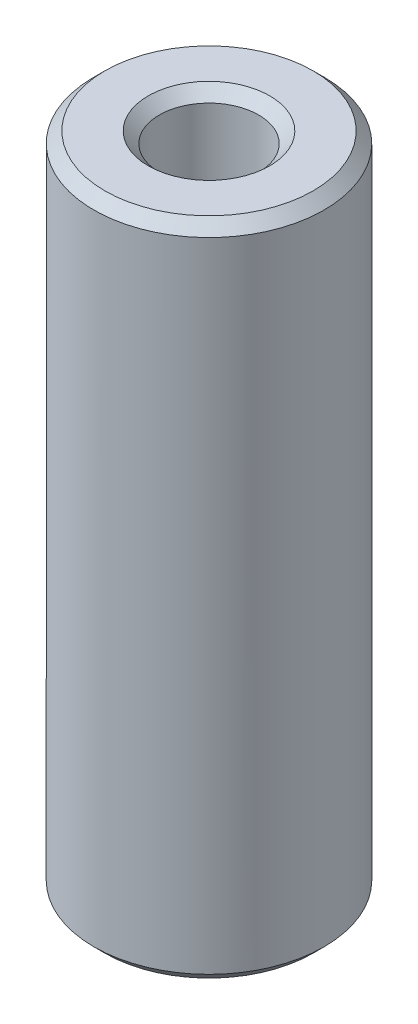
ISO-10303-21;
HEADER;
FILE_DESCRIPTION(('STEP AP214'),'2;1');
FILE_NAME('part.step','',(''),(''),'','','');
FILE_SCHEMA(('AUTOMOTIVE_DESIGN { 1 0 10303 214 1 1 1 1 }'));
ENDSEC;
DATA;
#1=APPLICATION_CONTEXT('core data for automotive mechanical design processes');
#2=APPLICATION_PROTOCOL_DEFINITION('international standard','automotive_design',2000,#1);
#3=PRODUCT_CONTEXT('',#1,'mechanical');
#4=PRODUCT('Part','Part','',(#3));
#5=PRODUCT_RELATED_PRODUCT_CATEGORY('part','',(#4));
#6=PRODUCT_DEFINITION_FORMATION('','',#4);
#7=PRODUCT_DEFINITION_CONTEXT('part definition',#1,'design');
#8=PRODUCT_DEFINITION('design','',#6,#7);
#9=PRODUCT_DEFINITION_SHAPE('','',#8);
#10=(LENGTH_UNIT() NAMED_UNIT(*) SI_UNIT(.MILLI.,.METRE.));
#11=(NAMED_UNIT(*) PLANE_ANGLE_UNIT() SI_UNIT($,.RADIAN.));
#12=(NAMED_UNIT(*) SI_UNIT($,.STERADIAN.) SOLID_ANGLE_UNIT());
#13=UNCERTAINTY_MEASURE_WITH_UNIT(LENGTH_MEASURE(1.E-05),#10,'distance_accuracy_value','');
#14=(GEOMETRIC_REPRESENTATION_CONTEXT(3) GLOBAL_UNCERTAINTY_ASSIGNED_CONTEXT((#13)) GLOBAL_UNIT_ASSIGNED_CONTEXT((#10,
#11,#12)) REPRESENTATION_CONTEXT('',''));
#15=CARTESIAN_POINT('',(0.,0.,0.));
#16=DIRECTION('',(0.,0.,1.));
#17=DIRECTION('',(1.,0.,0.));
#18=AXIS2_PLACEMENT_3D('',#15,#16,#17);
#19=CARTESIAN_POINT('',(0.,57.3546834768613,0.));
#20=DIRECTION('',(0.,-1.,0.));
#21=DIRECTION('',(0.,0.,-1.));
#22=AXIS2_PLACEMENT_3D('',#19,#20,#21);
#23=CYLINDRICAL_SURFACE('',#22,10.);
#24=CARTESIAN_POINT('',(0.,0.959451549505989,0.));
#25=DIRECTION('',(0.,1.,0.));
#26=DIRECTION('',(0.,0.,1.));
#27=AXIS2_PLACEMENT_3D('',#24,#25,#26);
#28=CIRCLE('',#27,10.);
#29=CARTESIAN_POINT('',(0.,0.959451549505989,-10.));
#30=VERTEX_POINT('',#29);
#31=EDGE_CURVE('E10',#30,#30,#28,.T.);
#32=CARTESIAN_POINT('',(0.,56.3952319273553,0.));
#33=DIRECTION('',(0.,1.,0.));
#34=DIRECTION('',(0.,0.,1.));
#35=AXIS2_PLACEMENT_3D('',#32,#33,#34);
#36=CIRCLE('',#35,10.);
#37=CARTESIAN_POINT('',(0.,56.3952319273553,-10.));
#38=VERTEX_POINT('',#37);
#39=EDGE_CURVE('E50',#38,#38,#36,.F.);
#40=CARTESIAN_POINT('',(0.,0.959451549505989,-10.));
#41=CARTESIAN_POINT('',(0.,1.53690759510859,-10.));
#42=CARTESIAN_POINT('',(0.,2.11436364071118,-10.));
#43=CARTESIAN_POINT('',(0.,3.26927573191638,-10.));
#44=CARTESIAN_POINT('',(0.,3.84673177751897,-10.));
#45=CARTESIAN_POINT('',(0.,5.00164386872416,-10.));
#46=CARTESIAN_POINT('',(0.,5.57909991432676,-10.));
#47=CARTESIAN_POINT('',(0.,6.73401200553195,-10.));
#48=CARTESIAN_POINT('',(0.,7.31146805113455,-10.));
#49=CARTESIAN_POINT('',(0.,8.46638014233974,-10.));
#50=CARTESIAN_POINT('',(0.,9.04383618794234,-10.));
#51=CARTESIAN_POINT('',(0.,10.1987482791475,-10.));
#52=CARTESIAN_POINT('',(0.,10.7762043247501,-10.));
#53=CARTESIAN_POINT('',(0.,11.9311164159553,-10.));
#54=CARTESIAN_POINT('',(0.,12.5085724615579,-10.));
#55=CARTESIAN_POINT('',(0.,13.6634845527631,-10.));
#56=CARTESIAN_POINT('',(0.,14.2409405983657,-10.));
#57=CARTESIAN_POINT('',(0.,15.3958526895709,-10.));
#58=CARTESIAN_POINT('',(0.,15.9733087351735,-10.));
#59=CARTESIAN_POINT('',(0.,17.1282208263787,-10.));
#60=CARTESIAN_POINT('',(0.,17.7056768719813,-10.));
#61=CARTESIAN_POINT('',(0.,18.8605889631865,-10.));
#62=CARTESIAN_POINT('',(0.,19.4380450087891,-10.));
#63=CARTESIAN_POINT('',(0.,20.5929570999943,-10.));
#64=CARTESIAN_POINT('',(0.,21.1704131455969,-10.));
#65=CARTESIAN_POINT('',(0.,22.3253252368021,-10.));
#66=CARTESIAN_POINT('',(0.,22.9027812824047,-10.));
#67=CARTESIAN_POINT('',(0.,24.0576933736099,-10.));
#68=CARTESIAN_POINT('',(0.,24.6351494192124,-10.));
#69=CARTESIAN_POINT('',(0.,25.7900615104176,-10.));
#70=CARTESIAN_POINT('',(0.,26.3675175560202,-10.));
#71=CARTESIAN_POINT('',(0.,27.5224296472254,-10.));
#72=CARTESIAN_POINT('',(0.,28.099885692828,-10.));
#73=CARTESIAN_POINT('',(0.,29.2547977840332,-10.));
#74=CARTESIAN_POINT('',(0.,29.8322538296358,-10.));
#75=CARTESIAN_POINT('',(0.,30.987165920841,-10.));
#76=CARTESIAN_POINT('',(0.,31.5646219664436,-10.));
#77=CARTESIAN_POINT('',(0.,32.7195340576488,-10.));
#78=CARTESIAN_POINT('',(0.,33.2969901032514,-10.));
#79=CARTESIAN_POINT('',(0.,34.4519021944566,-10.));
#80=CARTESIAN_POINT('',(0.,35.0293582400592,-10.));
#81=CARTESIAN_POINT('',(0.,36.1842703312644,-10.));
#82=CARTESIAN_POINT('',(0.,36.761726376867,-10.));
#83=CARTESIAN_POINT('',(0.,37.9166384680722,-10.));
#84=CARTESIAN_POINT('',(0.,38.4940945136748,-10.));
#85=CARTESIAN_POINT('',(0.,39.64900660488,-10.));
#86=CARTESIAN_POINT('',(0.,40.2264626504826,-10.));
#87=CARTESIAN_POINT('',(0.,41.3813747416877,-10.));
#88=CARTESIAN_POINT('',(0.,41.9588307872903,-10.));
#89=CARTESIAN_POINT('',(0.,43.1137428784955,-10.));
#90=CARTESIAN_POINT('',(0.,43.6911989240981,-10.));
#91=CARTESIAN_POINT('',(0.,44.8461110153033,-10.));
#92=CARTESIAN_POINT('',(0.,45.4235670609059,-10.));
#93=CARTESIAN_POINT('',(0.,46.5784791521111,-10.));
#94=CARTESIAN_POINT('',(0.,47.1559351977137,-10.));
#95=CARTESIAN_POINT('',(0.,48.3108472889189,-10.));
#96=CARTESIAN_POINT('',(0.,48.8883033345215,-10.));
#97=CARTESIAN_POINT('',(0.,50.0432154257267,-10.));
#98=CARTESIAN_POINT('',(0.,50.6206714713293,-10.));
#99=CARTESIAN_POINT('',(0.,51.7755835625345,-10.));
#100=CARTESIAN_POINT('',(0.,52.3530396081371,-10.));
#101=CARTESIAN_POINT('',(0.,53.5079516993423,-10.));
#102=CARTESIAN_POINT('',(0.,54.0854077449449,-10.));
#103=CARTESIAN_POINT('',(0.,55.2403198361501,-10.));
#104=CARTESIAN_POINT('',(0.,55.8177758817527,-10.));
#105=CARTESIAN_POINT('',(0.,56.3952319273553,-10.));
#106=B_SPLINE_CURVE_WITH_KNOTS('',3,(#40,#41,#42,#43,#44,#45,#46,#47,#48,#49,#50,#51,#52,#53,
#54,#55,#56,#57,#58,#59,#60,#61,#62,#63,#64,#65,#66,#67,#68,#69,#70,#71,#72,#73,#74,#75,#76,#77,
#78,#79,#80,#81,#82,#83,#84,#85,#86,#87,#88,#89,#90,#91,#92,#93,#94,#95,#96,#97,#98,#99,#100,
#101,#102,#103,#104,#105),.UNSPECIFIED.,.F.,.F.,(4,2,2,2,2,2,2,2,2,2,2,2,2,2,2,2,2,2,2,2,2,2,2,
2,2,2,2,2,2,2,2,2,4),(0.,1.73236813680779,3.46473627361558,5.19710441042337,6.92947254723116,
8.66184068403895,10.3942088208467,12.1265769576545,13.8589450944623,15.5913132312701,
17.3236813680779,19.0560495048857,20.7884176416935,22.5207857785013,24.2531539153091,
25.9855220521168,27.7178901889246,29.4502583257324,31.1826264625402,32.914994599348,
34.6473627361558,36.3797308729636,38.1120990097714,39.8444671465792,41.576835283387,
43.3092034201947,45.0415715570025,46.7739396938103,48.5063078306181,50.2386759674259,
51.9710441042337,53.7034122410415,55.4357803778493),.UNSPECIFIED.);
#107=EDGE_CURVE('BSEAM39',#30,#38,#106,.T.);
#108=ORIENTED_EDGE('',*,*,#31,.T.);
#109=ORIENTED_EDGE('',*,*,#39,.T.);
#110=ORIENTED_EDGE('',*,*,#107,.T.);
#111=ORIENTED_EDGE('',*,*,#107,.F.);
#112=EDGE_LOOP('',(#108,#110,#109,#111));
#113=FACE_BOUND('',#112,.T.);
#114=ADVANCED_FACE('F39',(#113),#23,.T.);
#115=CARTESIAN_POINT('',(0.,57.3546834768613,0.));
#116=DIRECTION('',(0.,1.,0.));
#117=DIRECTION('',(0.,0.,1.));
#118=AXIS2_PLACEMENT_3D('',#115,#116,#117);
#119=PLANE('',#118);
#120=CARTESIAN_POINT('',(0.,57.3546834768613,0.));
#121=DIRECTION('',(0.,1.,0.));
#122=DIRECTION('',(0.,0.,1.));
#123=AXIS2_PLACEMENT_3D('',#120,#121,#122);
#124=CIRCLE('',#123,5.27456071594514);
#125=CARTESIAN_POINT('',(0.,57.3546834768613,5.27456071594514));
#126=VERTEX_POINT('',#125);
#127=EDGE_CURVE('E58',#126,#126,#124,.F.);
#128=ORIENTED_EDGE('',*,*,#127,.T.);
#129=EDGE_LOOP('',(#128));
#130=FACE_BOUND('',#129,.T.);
#131=CARTESIAN_POINT('',(0.,57.3546834768613,0.));
#132=DIRECTION('',(0.,1.,0.));
#133=DIRECTION('',(0.,0.,1.));
#134=AXIS2_PLACEMENT_3D('',#131,#132,#133);
#135=CIRCLE('',#134,9.04054845049403);
#136=CARTESIAN_POINT('',(0.,57.3546834768613,-9.04054845049403));
#137=VERTEX_POINT('',#136);
#138=EDGE_CURVE('E61',#137,#137,#135,.T.);
#139=ORIENTED_EDGE('',*,*,#138,.T.);
#140=EDGE_LOOP('',(#139));
#141=FACE_BOUND('',#140,.T.);
#142=ADVANCED_FACE('F88',(#130,#141),#119,.T.);
#143=CARTESIAN_POINT('',(0.,0.,0.));
#144=DIRECTION('',(0.,1.,0.));
#145=DIRECTION('',(0.,0.,1.));
#146=AXIS2_PLACEMENT_3D('',#143,#144,#145);
#147=PLANE('',#146);
#148=CARTESIAN_POINT('',(0.,0.,0.));
#149=DIRECTION('',(0.,1.,0.));
#150=DIRECTION('',(0.,0.,1.));
#151=AXIS2_PLACEMENT_3D('',#148,#149,#150);
#152=CIRCLE('',#151,5.27456071594514);
#153=CARTESIAN_POINT('',(0.,0.,5.27456071594514));
#154=VERTEX_POINT('',#153);
#155=EDGE_CURVE('E51',#154,#154,#152,.T.);
#156=ORIENTED_EDGE('',*,*,#155,.T.);
#157=EDGE_LOOP('',(#156));
#158=FACE_BOUND('',#157,.T.);
#159=CARTESIAN_POINT('',(0.,0.,0.));
#160=DIRECTION('',(0.,1.,0.));
#161=DIRECTION('',(0.,0.,1.));
#162=AXIS2_PLACEMENT_3D('',#159,#160,#161);
#163=CIRCLE('',#162,9.04054845049401);
#164=CARTESIAN_POINT('',(0.,0.,9.04054845049401));
#165=VERTEX_POINT('',#164);
#166=EDGE_CURVE('E54',#165,#165,#163,.F.);
#167=ORIENTED_EDGE('',*,*,#166,.T.);
#168=EDGE_LOOP('',(#167));
#169=FACE_BOUND('',#168,.T.);
#170=ADVANCED_FACE('F83',(#158,#169),#147,.F.);
#171=CARTESIAN_POINT('',(0.,57.3546834768613,0.));
#172=DIRECTION('',(0.,-1.,0.));
#173=DIRECTION('',(0.,0.,-1.));
#174=AXIS2_PLACEMENT_3D('',#171,#172,#173);
#175=CYLINDRICAL_SURFACE('',#174,4.31510916643915);
#176=CARTESIAN_POINT('',(0.,56.3952319273553,0.));
#177=DIRECTION('',(0.,1.,0.));
#178=DIRECTION('',(0.,0.,1.));
#179=AXIS2_PLACEMENT_3D('',#176,#177,#178);
#180=CIRCLE('',#179,4.31510916643915);
#181=CARTESIAN_POINT('',(0.,56.3952319273553,4.31510916643915));
#182=VERTEX_POINT('',#181);
#183=EDGE_CURVE('E67',#182,#182,#180,.T.);
#184=ORIENTED_EDGE('',*,*,#183,.T.);
#185=EDGE_LOOP('',(#184));
#186=FACE_BOUND('',#185,.T.);
#187=CARTESIAN_POINT('',(0.,0.959451549505996,0.));
#188=DIRECTION('',(0.,1.,0.));
#189=DIRECTION('',(0.,0.,1.));
#190=AXIS2_PLACEMENT_3D('',#187,#188,#189);
#191=CIRCLE('',#190,4.31510916643915);
#192=CARTESIAN_POINT('',(0.,0.959451549505996,4.31510916643915));
#193=VERTEX_POINT('',#192);
#194=EDGE_CURVE('E69',#193,#193,#191,.F.);
#195=ORIENTED_EDGE('',*,*,#194,.T.);
#196=EDGE_LOOP('',(#195));
#197=FACE_BOUND('',#196,.T.);
#198=ADVANCED_FACE('F71',(#186,#197),#175,.F.);
#199=CARTESIAN_POINT('',(0.,56.3952319273553,0.));
#200=DIRECTION('',(0.,1.,0.));
#201=DIRECTION('',(0.,0.,1.));
#202=AXIS2_PLACEMENT_3D('',#199,#200,#201);
#203=CONICAL_SURFACE('',#202,4.31510916643915,0.785398163397447);
#204=CARTESIAN_POINT('',(0.,57.3546834768613,5.27456071594514));
#205=CARTESIAN_POINT('',(0.,57.3446891898872,5.26456642897112));
#206=CARTESIAN_POINT('',(0.,57.3346949029132,5.2545721419971));
#207=CARTESIAN_POINT('',(0.,57.3147063289652,5.23458356804906));
#208=CARTESIAN_POINT('',(0.,57.3047120419911,5.22458928107504));
#209=CARTESIAN_POINT('',(0.,57.2847234680431,5.20460070712699));
#210=CARTESIAN_POINT('',(0.,57.2747291810691,5.19460642015297));
#211=CARTESIAN_POINT('',(0.,57.254740607121,5.17461784620493));
#212=CARTESIAN_POINT('',(0.,57.244746320147,5.16462355923091));
#213=CARTESIAN_POINT('',(0.,57.224757746199,5.14463498528287));
#214=CARTESIAN_POINT('',(0.,57.214763459225,5.13464069830885));
#215=CARTESIAN_POINT('',(0.,57.1947748852769,5.11465212436081));
#216=CARTESIAN_POINT('',(0.,57.1847805983029,5.10465783738679));
#217=CARTESIAN_POINT('',(0.,57.1647920243549,5.08466926343874));
#218=CARTESIAN_POINT('',(0.,57.1547977373808,5.07467497646472));
#219=CARTESIAN_POINT('',(0.,57.1348091634328,5.05468640251668));
#220=CARTESIAN_POINT('',(0.,57.1248148764588,5.04469211554266));
#221=CARTESIAN_POINT('',(0.,57.1048263025107,5.02470354159462));
#222=CARTESIAN_POINT('',(0.,57.0948320155367,5.0147092546206));
#223=CARTESIAN_POINT('',(0.,57.0748434415887,4.99472068067256));
#224=CARTESIAN_POINT('',(0.,57.0648491546146,4.98472639369854));
#225=CARTESIAN_POINT('',(0.,57.0448605806666,4.9647378197505));
#226=CARTESIAN_POINT('',(0.,57.0348662936926,4.95474353277648));
#227=CARTESIAN_POINT('',(0.,57.0148777197445,4.93475495882843));
#228=CARTESIAN_POINT('',(0.,57.0048834327705,4.92476067185441));
#229=CARTESIAN_POINT('',(0.,56.9848948588225,4.90477209790637));
#230=CARTESIAN_POINT('',(0.,56.9749005718485,4.89477781093235));
#231=CARTESIAN_POINT('',(0.,56.9549119979004,4.87478923698431));
#232=CARTESIAN_POINT('',(0.,56.9449177109264,4.86479495001029));
#233=CARTESIAN_POINT('',(0.,56.9249291369784,4.84480637606225));
#234=CARTESIAN_POINT('',(0.,56.9149348500043,4.83481208908823));
#235=CARTESIAN_POINT('',(0.,56.8949462760563,4.81482351514019));
#236=CARTESIAN_POINT('',(0.,56.8849519890823,4.80482922816616));
#237=CARTESIAN_POINT('',(0.,56.8649634151342,4.78484065421812));
#238=CARTESIAN_POINT('',(0.,56.8549691281602,4.7748463672441));
#239=CARTESIAN_POINT('',(0.,56.8349805542122,4.75485779329606));
#240=CARTESIAN_POINT('',(0.,56.8249862672382,4.74486350632204));
#241=CARTESIAN_POINT('',(0.,56.8049976932901,4.724874932374));
#242=CARTESIAN_POINT('',(0.,56.7950034063161,4.71488064539998));
#243=CARTESIAN_POINT('',(0.,56.7750148323681,4.69489207145194));
#244=CARTESIAN_POINT('',(0.,56.765020545394,4.68489778447792));
#245=CARTESIAN_POINT('',(0.,56.745031971446,4.66490921052988));
#246=CARTESIAN_POINT('',(0.,56.735037684472,4.65491492355585));
#247=CARTESIAN_POINT('',(0.,56.7150491105239,4.63492634960781));
#248=CARTESIAN_POINT('',(0.,56.7050548235499,4.62493206263379));
#249=CARTESIAN_POINT('',(0.,56.6850662496019,4.60494348868575));
#250=CARTESIAN_POINT('',(0.,56.6750719626278,4.59494920171173));
#251=CARTESIAN_POINT('',(0.,56.6550833886798,4.57496062776369));
#252=CARTESIAN_POINT('',(0.,56.6450891017058,4.56496634078967));
#253=CARTESIAN_POINT('',(0.,56.6251005277577,4.54497776684163));
#254=CARTESIAN_POINT('',(0.,56.6151062407837,4.53498347986761));
#255=CARTESIAN_POINT('',(0.,56.5951176668357,4.51499490591957));
#256=CARTESIAN_POINT('',(0.,56.5851233798617,4.50500061894554));
#257=CARTESIAN_POINT('',(0.,56.5651348059136,4.4850120449975));
#258=CARTESIAN_POINT('',(0.,56.5551405189396,4.47501775802348));
#259=CARTESIAN_POINT('',(0.,56.5351519449916,4.45502918407544));
#260=CARTESIAN_POINT('',(0.,56.5251576580175,4.44503489710142));
#261=CARTESIAN_POINT('',(0.,56.5051690840695,4.42504632315338));
#262=CARTESIAN_POINT('',(0.,56.4951747970955,4.41505203617936));
#263=CARTESIAN_POINT('',(0.,56.4751862231474,4.39506346223132));
#264=CARTESIAN_POINT('',(0.,56.4651919361734,4.3850691752573));
#265=CARTESIAN_POINT('',(0.,56.4452033622254,4.36508060130925));
#266=CARTESIAN_POINT('',(0.,56.4352090752514,4.35508631433523));
#267=CARTESIAN_POINT('',(0.,56.4152205013033,4.33509774038719));
#268=CARTESIAN_POINT('',(0.,56.4052262143293,4.32510345341317));
#269=CARTESIAN_POINT('',(0.,56.3952319273553,4.31510916643915));
#270=B_SPLINE_CURVE_WITH_KNOTS('',3,(#204,#205,#206,#207,#208,#209,#210,#211,#212,#213,#214,
#215,#216,#217,#218,#219,#220,#221,#222,#223,#224,#225,#226,#227,#228,#229,#230,#231,#232,#233,
#234,#235,#236,#237,#238,#239,#240,#241,#242,#243,#244,#245,#246,#247,#248,#249,#250,#251,#252,
#253,#254,#255,#256,#257,#258,#259,#260,#261,#262,#263,#264,#265,#266,#267,#268,#269),
.UNSPECIFIED.,.F.,.F.,(4,2,2,2,2,2,2,2,2,2,2,2,2,2,2,2,2,2,2,2,2,2,2,2,2,2,2,2,2,2,2,2,4),(0.,
0.04240216855473,0.0848043371094556,0.127206505664181,0.169608674218906,0.212010842773637,
0.254413011328363,0.296815179883088,0.339217348437813,0.381619516992539,0.424021685547269,
0.466423854101995,0.50882602265672,0.551228191211445,0.593630359766176,0.636032528320902,
0.678434696875627,0.720836865430353,0.763239033985078,0.805641202539808,0.848043371094534,
0.89044553964926,0.932847708203985,0.975249876758715,1.01765204531344,1.06005421386817,
1.10245638242289,1.14485855097762,1.18726071953235,1.22966288808707,1.2720650566418,
1.31446722519652,1.35686939375125),.UNSPECIFIED.);
#271=EDGE_CURVE('BSEAM77',#126,#182,#270,.T.);
#272=ORIENTED_EDGE('',*,*,#127,.F.);
#273=ORIENTED_EDGE('',*,*,#183,.F.);
#274=ORIENTED_EDGE('',*,*,#271,.T.);
#275=ORIENTED_EDGE('',*,*,#271,.F.);
#276=EDGE_LOOP('',(#272,#274,#273,#275));
#277=FACE_BOUND('',#276,.T.);
#278=ADVANCED_FACE('F77',(#277),#203,.F.);
#279=CARTESIAN_POINT('',(0.,0.,0.));
#280=DIRECTION('',(0.,-1.,0.));
#281=DIRECTION('',(0.,0.,-1.));
#282=AXIS2_PLACEMENT_3D('',#279,#280,#281);
#283=CONICAL_SURFACE('',#282,5.27456071594514,0.785398163397443);
#284=ORIENTED_EDGE('',*,*,#194,.F.);
#285=EDGE_LOOP('',(#284));
#286=FACE_BOUND('',#285,.T.);
#287=ORIENTED_EDGE('',*,*,#155,.F.);
#288=EDGE_LOOP('',(#287));
#289=FACE_BOUND('',#288,.T.);
#290=ADVANCED_FACE('F73',(#286,#289),#283,.F.);
#291=CARTESIAN_POINT('',(0.,0.959451549505989,0.));
#292=DIRECTION('',(0.,1.,0.));
#293=DIRECTION('',(0.,0.,1.));
#294=AXIS2_PLACEMENT_3D('',#291,#292,#293);
#295=CONICAL_SURFACE('',#294,10.,0.785398163397452);
#296=ORIENTED_EDGE('',*,*,#166,.F.);
#297=EDGE_LOOP('',(#296));
#298=FACE_BOUND('',#297,.T.);
#299=ORIENTED_EDGE('',*,*,#31,.F.);
#300=EDGE_LOOP('',(#299));
#301=FACE_BOUND('',#300,.T.);
#302=ADVANCED_FACE('F76',(#298,#301),#295,.T.);
#303=CARTESIAN_POINT('',(0.,57.3546834768613,0.));
#304=DIRECTION('',(0.,-1.,0.));
#305=DIRECTION('',(0.,0.,-1.));
#306=AXIS2_PLACEMENT_3D('',#303,#304,#305);
#307=CONICAL_SURFACE('',#306,9.04054845049403,0.785398163397441);
#308=CARTESIAN_POINT('',(0.,56.3952319273553,-10.));
#309=CARTESIAN_POINT('',(0.,56.4052262143293,-9.99000571302599));
#310=CARTESIAN_POINT('',(0.,56.4152205013033,-9.98001142605197));
#311=CARTESIAN_POINT('',(0.,56.4352090752514,-9.96002285210392));
#312=CARTESIAN_POINT('',(0.,56.4452033622254,-9.9500285651299));
#313=CARTESIAN_POINT('',(0.,56.4651919361734,-9.93003999118186));
#314=CARTESIAN_POINT('',(0.,56.4751862231474,-9.92004570420784));
#315=CARTESIAN_POINT('',(0.,56.4951747970955,-9.9000571302598));
#316=CARTESIAN_POINT('',(0.,56.5051690840695,-9.89006284328578));
#317=CARTESIAN_POINT('',(0.,56.5251576580175,-9.87007426933774));
#318=CARTESIAN_POINT('',(0.,56.5351519449916,-9.86007998236372));
#319=CARTESIAN_POINT('',(0.,56.5551405189396,-9.84009140841568));
#320=CARTESIAN_POINT('',(0.,56.5651348059136,-9.83009712144166));
#321=CARTESIAN_POINT('',(0.,56.5851233798617,-9.81010854749361));
#322=CARTESIAN_POINT('',(0.,56.5951176668357,-9.80011426051959));
#323=CARTESIAN_POINT('',(0.,56.6151062407837,-9.78012568657155));
#324=CARTESIAN_POINT('',(0.,56.6251005277577,-9.77013139959753));
#325=CARTESIAN_POINT('',(0.,56.6450891017058,-9.75014282564949));
#326=CARTESIAN_POINT('',(0.,56.6550833886798,-9.74014853867547));
#327=CARTESIAN_POINT('',(0.,56.6750719626278,-9.72015996472743));
#328=CARTESIAN_POINT('',(0.,56.6850662496019,-9.71016567775341));
#329=CARTESIAN_POINT('',(0.,56.7050548235499,-9.69017710380537));
#330=CARTESIAN_POINT('',(0.,56.7150491105239,-9.68018281683135));
#331=CARTESIAN_POINT('',(0.,56.735037684472,-9.66019424288331));
#332=CARTESIAN_POINT('',(0.,56.745031971446,-9.65019995590928));
#333=CARTESIAN_POINT('',(0.,56.765020545394,-9.63021138196125));
#334=CARTESIAN_POINT('',(0.,56.7750148323681,-9.62021709498722));
#335=CARTESIAN_POINT('',(0.,56.7950034063161,-9.60022852103918));
#336=CARTESIAN_POINT('',(0.,56.8049976932901,-9.59023423406516));
#337=CARTESIAN_POINT('',(0.,56.8249862672382,-9.57024566011712));
#338=CARTESIAN_POINT('',(0.,56.8349805542122,-9.5602513731431));
#339=CARTESIAN_POINT('',(0.,56.8549691281602,-9.54026279919506));
#340=CARTESIAN_POINT('',(0.,56.8649634151342,-9.53026851222104));
#341=CARTESIAN_POINT('',(0.,56.8849519890823,-9.510279938273));
#342=CARTESIAN_POINT('',(0.,56.8949462760563,-9.50028565129898));
#343=CARTESIAN_POINT('',(0.,56.9149348500043,-9.48029707735093));
#344=CARTESIAN_POINT('',(0.,56.9249291369784,-9.47030279037691));
#345=CARTESIAN_POINT('',(0.,56.9449177109264,-9.45031421642887));
#346=CARTESIAN_POINT('',(0.,56.9549119979004,-9.44031992945485));
#347=CARTESIAN_POINT('',(0.,56.9749005718485,-9.42033135550681));
#348=CARTESIAN_POINT('',(0.,56.9848948588225,-9.41033706853279));
#349=CARTESIAN_POINT('',(0.,57.0048834327705,-9.39034849458475));
#350=CARTESIAN_POINT('',(0.,57.0148777197445,-9.38035420761073));
#351=CARTESIAN_POINT('',(0.,57.0348662936926,-9.36036563366269));
#352=CARTESIAN_POINT('',(0.,57.0448605806666,-9.35037134668867));
#353=CARTESIAN_POINT('',(0.,57.0648491546146,-9.33038277274063));
#354=CARTESIAN_POINT('',(0.,57.0748434415887,-9.32038848576661));
#355=CARTESIAN_POINT('',(0.,57.0948320155367,-9.30039991181857));
#356=CARTESIAN_POINT('',(0.,57.1048263025107,-9.29040562484455));
#357=CARTESIAN_POINT('',(0.,57.1248148764588,-9.2704170508965));
#358=CARTESIAN_POINT('',(0.,57.1348091634328,-9.26042276392248));
#359=CARTESIAN_POINT('',(0.,57.1547977373808,-9.24043418997444));
#360=CARTESIAN_POINT('',(0.,57.1647920243549,-9.23043990300042));
#361=CARTESIAN_POINT('',(0.,57.1847805983029,-9.21045132905238));
#362=CARTESIAN_POINT('',(0.,57.1947748852769,-9.20045704207836));
#363=CARTESIAN_POINT('',(0.,57.214763459225,-9.18046846813032));
#364=CARTESIAN_POINT('',(0.,57.224757746199,-9.1704741811563));
#365=CARTESIAN_POINT('',(0.,57.244746320147,-9.15048560720825));
#366=CARTESIAN_POINT('',(0.,57.254740607121,-9.14049132023424));
#367=CARTESIAN_POINT('',(0.,57.2747291810691,-9.1205027462862));
#368=CARTESIAN_POINT('',(0.,57.2847234680431,-9.11050845931217));
#369=CARTESIAN_POINT('',(0.,57.3047120419911,-9.09051988536413));
#370=CARTESIAN_POINT('',(0.,57.3147063289652,-9.08052559839011));
#371=CARTESIAN_POINT('',(0.,57.3346949029132,-9.06053702444207));
#372=CARTESIAN_POINT('',(0.,57.3446891898872,-9.05054273746805));
#373=CARTESIAN_POINT('',(0.,57.3546834768613,-9.04054845049403));
#374=B_SPLINE_CURVE_WITH_KNOTS('',3,(#308,#309,#310,#311,#312,#313,#314,#315,#316,#317,#318,
#319,#320,#321,#322,#323,#324,#325,#326,#327,#328,#329,#330,#331,#332,#333,#334,#335,#336,#337,
#338,#339,#340,#341,#342,#343,#344,#345,#346,#347,#348,#349,#350,#351,#352,#353,#354,#355,#356,
#357,#358,#359,#360,#361,#362,#363,#364,#365,#366,#367,#368,#369,#370,#371,#372,#373),
.UNSPECIFIED.,.F.,.F.,(4,2,2,2,2,2,2,2,2,2,2,2,2,2,2,2,2,2,2,2,2,2,2,2,2,2,2,2,2,2,2,2,4),(0.,
0.0424021685547294,0.084804337109455,0.127206505664181,0.169608674218905,0.212010842773636,
0.254413011328361,0.296815179883086,0.339217348437812,0.381619516992537,0.424021685547267,
0.466423854101992,0.508826022656717,0.551228191211442,0.593630359766173,0.636032528320897,
0.678434696875623,0.720836865430349,0.763239033985073,0.805641202539804,0.848043371094528,
0.890445539649254,0.93284770820398,0.975249876758709,1.01765204531343,1.06005421386816,
1.10245638242288,1.14485855097761,1.18726071953234,1.22966288808707,1.27206505664179,
1.31446722519652,1.35686939375125),.UNSPECIFIED.);
#375=EDGE_CURVE('BSEAM45',#38,#137,#374,.T.);
#376=ORIENTED_EDGE('',*,*,#39,.F.);
#377=ORIENTED_EDGE('',*,*,#138,.F.);
#378=ORIENTED_EDGE('',*,*,#375,.T.);
#379=ORIENTED_EDGE('',*,*,#375,.F.);
#380=EDGE_LOOP('',(#376,#378,#377,#379));
#381=FACE_BOUND('',#380,.T.);
#382=ADVANCED_FACE('F45',(#381),#307,.T.);
#383=CLOSED_SHELL('',(#114,#142,#170,#198,#278,#290,#302,#382));
#384=MANIFOLD_SOLID_BREP('B2',#383);
#385=ADVANCED_BREP_SHAPE_REPRESENTATION('',(#18,#384),#14);
#386=SHAPE_DEFINITION_REPRESENTATION(#9,#385);
ENDSEC;
END-ISO-10303-21;
